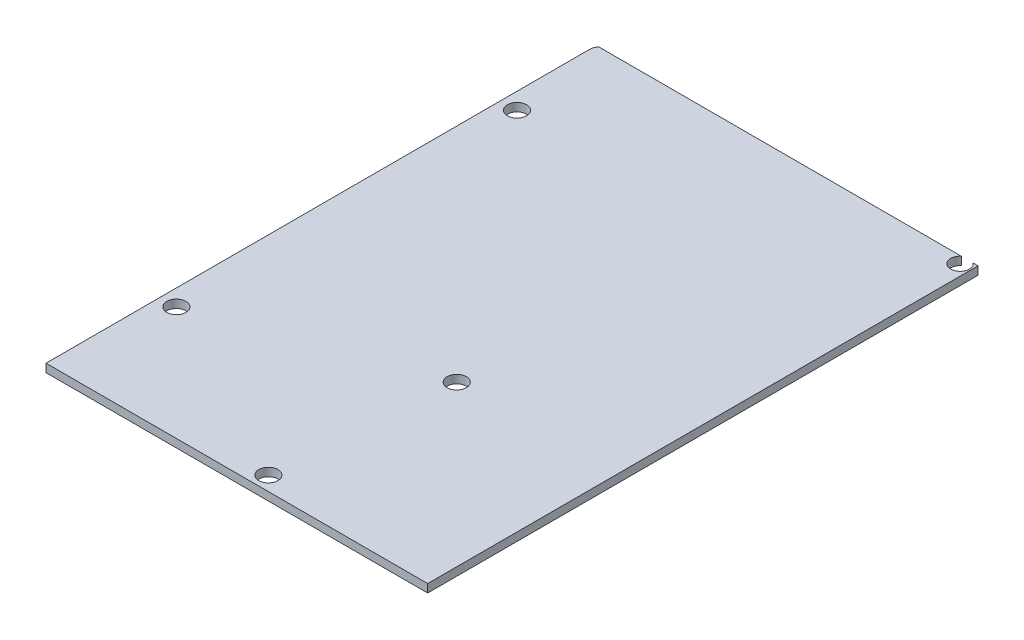
ISO-10303-21;
HEADER;
FILE_DESCRIPTION(('STEP AP214'),'2;1');
FILE_NAME('part.step','',(''),(''),'','','');
FILE_SCHEMA(('AUTOMOTIVE_DESIGN { 1 0 10303 214 1 1 1 1 }'));
ENDSEC;
DATA;
#1=APPLICATION_CONTEXT('core data for automotive mechanical design processes');
#2=APPLICATION_PROTOCOL_DEFINITION('international standard','automotive_design',2000,#1);
#3=PRODUCT_CONTEXT('',#1,'mechanical');
#4=PRODUCT('Part','Part','',(#3));
#5=PRODUCT_RELATED_PRODUCT_CATEGORY('part','',(#4));
#6=PRODUCT_DEFINITION_FORMATION('','',#4);
#7=PRODUCT_DEFINITION_CONTEXT('part definition',#1,'design');
#8=PRODUCT_DEFINITION('design','',#6,#7);
#9=PRODUCT_DEFINITION_SHAPE('','',#8);
#10=(LENGTH_UNIT() NAMED_UNIT(*) SI_UNIT(.MILLI.,.METRE.));
#11=(NAMED_UNIT(*) PLANE_ANGLE_UNIT() SI_UNIT($,.RADIAN.));
#12=(NAMED_UNIT(*) SI_UNIT($,.STERADIAN.) SOLID_ANGLE_UNIT());
#13=UNCERTAINTY_MEASURE_WITH_UNIT(LENGTH_MEASURE(1.E-05),#10,'distance_accuracy_value','');
#14=(GEOMETRIC_REPRESENTATION_CONTEXT(3) GLOBAL_UNCERTAINTY_ASSIGNED_CONTEXT((#13)) GLOBAL_UNIT_ASSIGNED_CONTEXT((#10,
#11,#12)) REPRESENTATION_CONTEXT('',''));
#15=CARTESIAN_POINT('',(0.,0.,0.));
#16=DIRECTION('',(0.,0.,1.));
#17=DIRECTION('',(1.,0.,0.));
#18=AXIS2_PLACEMENT_3D('',#15,#16,#17);
#19=CARTESIAN_POINT('',(-2.655,1.5,-0.520482398309197));
#20=DIRECTION('',(0.,1.,0.));
#21=DIRECTION('',(1.,0.,0.));
#22=AXIS2_PLACEMENT_3D('',#19,#20,#21);
#23=PLANE('',#22);
#24=CARTESIAN_POINT('',(-39.6,1.5,27.8));
#25=DIRECTION('',(0.,-1.,0.));
#26=DIRECTION('',(1.,0.,0.));
#27=AXIS2_PLACEMENT_3D('',#24,#25,#26);
#28=CIRCLE('',#27,1.75);
#29=CARTESIAN_POINT('',(-37.85,1.5,27.8));
#30=VERTEX_POINT('',#29);
#31=CARTESIAN_POINT('',(-41.35,1.5,27.8));
#32=VERTEX_POINT('',#31);
#33=EDGE_CURVE('E235',#30,#32,#28,.T.);
#34=ORIENTED_EDGE('',*,*,#33,.T.);
#35=CARTESIAN_POINT('',(-39.6,1.5,27.8));
#36=DIRECTION('',(0.,-1.,0.));
#37=DIRECTION('',(1.,0.,0.));
#38=AXIS2_PLACEMENT_3D('',#35,#36,#37);
#39=CIRCLE('',#38,1.75);
#40=EDGE_CURVE('E223',#32,#30,#39,.T.);
#41=ORIENTED_EDGE('',*,*,#40,.T.);
#42=EDGE_LOOP('',(#34,#41));
#43=FACE_BOUND('',#42,.T.);
#44=CARTESIAN_POINT('',(-2.1,1.5,14.1));
#45=DIRECTION('',(0.,-1.,0.));
#46=DIRECTION('',(1.,0.,0.));
#47=AXIS2_PLACEMENT_3D('',#44,#45,#46);
#48=CIRCLE('',#47,1.75);
#49=CARTESIAN_POINT('',(-0.350000000000008,1.5,14.1));
#50=VERTEX_POINT('',#49);
#51=CARTESIAN_POINT('',(-3.85,1.5,14.1));
#52=VERTEX_POINT('',#51);
#53=EDGE_CURVE('E244',#50,#52,#48,.T.);
#54=ORIENTED_EDGE('',*,*,#53,.T.);
#55=CARTESIAN_POINT('',(-2.1,1.5,14.1));
#56=DIRECTION('',(0.,-1.,0.));
#57=DIRECTION('',(1.,0.,0.));
#58=AXIS2_PLACEMENT_3D('',#55,#56,#57);
#59=CIRCLE('',#58,1.75);
#60=EDGE_CURVE('E112',#52,#50,#59,.T.);
#61=ORIENTED_EDGE('',*,*,#60,.T.);
#62=EDGE_LOOP('',(#54,#61));
#63=FACE_BOUND('',#62,.T.);
#64=CARTESIAN_POINT('',(-39.6,1.5,-34.4));
#65=DIRECTION('',(0.,-1.,0.));
#66=DIRECTION('',(1.,0.,0.));
#67=AXIS2_PLACEMENT_3D('',#64,#65,#66);
#68=CIRCLE('',#67,1.75);
#69=CARTESIAN_POINT('',(-37.85,1.5,-34.4));
#70=VERTEX_POINT('',#69);
#71=CARTESIAN_POINT('',(-41.35,1.5,-34.4));
#72=VERTEX_POINT('',#71);
#73=EDGE_CURVE('E209',#70,#72,#68,.T.);
#74=ORIENTED_EDGE('',*,*,#73,.T.);
#75=CARTESIAN_POINT('',(-39.6,1.5,-34.4));
#76=DIRECTION('',(0.,-1.,0.));
#77=DIRECTION('',(1.,0.,0.));
#78=AXIS2_PLACEMENT_3D('',#75,#76,#77);
#79=CIRCLE('',#78,1.75);
#80=EDGE_CURVE('E101',#72,#70,#79,.T.);
#81=ORIENTED_EDGE('',*,*,#80,.T.);
#82=EDGE_LOOP('',(#74,#81));
#83=FACE_BOUND('',#82,.T.);
#84=CARTESIAN_POINT('',(-4.6,1.5,46.));
#85=DIRECTION('',(0.,-1.,0.));
#86=DIRECTION('',(1.,0.,0.));
#87=AXIS2_PLACEMENT_3D('',#84,#85,#86);
#88=CIRCLE('',#87,1.75);
#89=CARTESIAN_POINT('',(-2.85,1.5,46.));
#90=VERTEX_POINT('',#89);
#91=CARTESIAN_POINT('',(-6.35,1.5,46.));
#92=VERTEX_POINT('',#91);
#93=EDGE_CURVE('E170',#90,#92,#88,.T.);
#94=ORIENTED_EDGE('',*,*,#93,.T.);
#95=CARTESIAN_POINT('',(-4.6,1.5,46.));
#96=DIRECTION('',(0.,-1.,0.));
#97=DIRECTION('',(1.,0.,0.));
#98=AXIS2_PLACEMENT_3D('',#95,#96,#97);
#99=CIRCLE('',#98,1.75);
#100=EDGE_CURVE('E167',#92,#90,#99,.T.);
#101=ORIENTED_EDGE('',*,*,#100,.T.);
#102=EDGE_LOOP('',(#94,#101));
#103=FACE_BOUND('',#102,.T.);
#104=CARTESIAN_POINT('',(25.1353213902922,1.5,-50.5909647966184));
#105=DIRECTION('',(0.,-1.,0.));
#106=DIRECTION('',(1.,0.,0.));
#107=AXIS2_PLACEMENT_3D('',#104,#105,#106);
#108=CIRCLE('',#107,1.7);
#109=CARTESIAN_POINT('',(26.2287993093726,1.49999995944139,-51.8926199124165));
#110=VERTEX_POINT('',#109);
#111=CARTESIAN_POINT('',(24.0418434712117,1.49999995944139,-51.8926199124165));
#112=VERTEX_POINT('',#111);
#113=EDGE_CURVE('E256',#110,#112,#108,.T.);
#114=ORIENTED_EDGE('',*,*,#113,.T.);
#115=DIRECTION('',(-1.,0.,0.));
#116=VECTOR('',#115,1.);
#117=CARTESIAN_POINT('',(-21.0630749900934,1.5,-51.8926199124165));
#118=LINE('',#117,#116);
#119=CARTESIAN_POINT('',(-42.1261499801869,1.49999995944139,-51.8926199124165));
#120=VERTEX_POINT('',#119);
#121=EDGE_CURVE('E236',#112,#120,#118,.T.);
#122=ORIENTED_EDGE('',*,*,#121,.T.);
#123=CARTESIAN_POINT('',(-40.6,1.5,-50.6));
#124=DIRECTION('',(0.,-1.,0.));
#125=DIRECTION('',(-0.707106781186548,0.,-0.707106781186548));
#126=AXIS2_PLACEMENT_3D('',#123,#124,#125);
#127=CIRCLE('',#126,2.);
#128=CARTESIAN_POINT('',(-42.6,1.5,-50.6));
#129=VERTEX_POINT('',#128);
#130=EDGE_CURVE('E195',#129,#120,#127,.T.);
#131=ORIENTED_EDGE('',*,*,#130,.F.);
#132=DIRECTION('',(0.,0.,1.));
#133=VECTOR('',#132,1.);
#134=CARTESIAN_POINT('',(-42.6,1.5,-52.6));
#135=LINE('',#134,#133);
#136=CARTESIAN_POINT('',(-42.6,1.49999995944139,48.6073800875835));
#137=VERTEX_POINT('',#136);
#138=EDGE_CURVE('E194',#129,#137,#135,.T.);
#139=ORIENTED_EDGE('',*,*,#138,.T.);
#140=DIRECTION('',(-1.,0.,0.));
#141=VECTOR('',#140,1.);
#142=CARTESIAN_POINT('',(-42.9,1.49999995944139,48.6073800875835));
#143=LINE('',#142,#141);
#144=CARTESIAN_POINT('',(27.1,1.49999995944139,48.6073800875835));
#145=VERTEX_POINT('',#144);
#146=EDGE_CURVE('E11',#145,#137,#143,.T.);
#147=ORIENTED_EDGE('',*,*,#146,.F.);
#148=DIRECTION('',(0.,0.,1.));
#149=VECTOR('',#148,1.);
#150=CARTESIAN_POINT('',(27.1,1.49999995944139,48.6073800875835));
#151=LINE('',#150,#149);
#152=CARTESIAN_POINT('',(27.1,1.49999995944139,-51.8926199124165));
#153=VERTEX_POINT('',#152);
#154=EDGE_CURVE('E206',#153,#145,#151,.T.);
#155=ORIENTED_EDGE('',*,*,#154,.F.);
#156=DIRECTION('',(-1.,0.,0.));
#157=VECTOR('',#156,1.);
#158=CARTESIAN_POINT('',(13.1143996546863,1.5,-51.8926199124165));
#159=LINE('',#158,#157);
#160=EDGE_CURVE('E239',#153,#110,#159,.T.);
#161=ORIENTED_EDGE('',*,*,#160,.T.);
#162=EDGE_LOOP('',(#114,#122,#131,#139,#147,#155,#161));
#163=FACE_BOUND('',#162,.T.);
#164=ADVANCED_FACE('F17',(#43,#63,#83,#103,#163),#23,.T.);
#165=CARTESIAN_POINT('',(27.1,4.05586098040089E-08,48.6073800875835));
#166=DIRECTION('',(0.,0.,-1.));
#167=DIRECTION('',(0.,-1.,0.));
#168=AXIS2_PLACEMENT_3D('',#165,#166,#167);
#169=PLANE('',#168);
#170=DIRECTION('',(-1.,0.,0.));
#171=VECTOR('',#170,1.);
#172=CARTESIAN_POINT('',(13.55,0.,48.6073800875835));
#173=LINE('',#172,#171);
#174=CARTESIAN_POINT('',(27.1,4.05586098040089E-08,48.6073800875835));
#175=VERTEX_POINT('',#174);
#176=CARTESIAN_POINT('',(-42.6,4.05586098040089E-08,48.6073800875835));
#177=VERTEX_POINT('',#176);
#178=EDGE_CURVE('E201',#175,#177,#173,.T.);
#179=ORIENTED_EDGE('',*,*,#178,.F.);
#180=DIRECTION('',(0.,1.,0.));
#181=VECTOR('',#180,1.);
#182=CARTESIAN_POINT('',(27.1,4.05586098040089E-08,48.6073800875835));
#183=LINE('',#182,#181);
#184=EDGE_CURVE('E27',#175,#145,#183,.T.);
#185=ORIENTED_EDGE('',*,*,#184,.T.);
#186=ORIENTED_EDGE('',*,*,#146,.T.);
#187=DIRECTION('',(0.,1.,0.));
#188=VECTOR('',#187,1.);
#189=CARTESIAN_POINT('',(-42.6,2.02793049020045E-08,48.6073800875835));
#190=LINE('',#189,#188);
#191=EDGE_CURVE('E69',#177,#137,#190,.T.);
#192=ORIENTED_EDGE('',*,*,#191,.F.);
#193=EDGE_LOOP('',(#179,#185,#186,#192));
#194=FACE_BOUND('',#193,.T.);
#195=ADVANCED_FACE('F291',(#194),#169,.F.);
#196=CARTESIAN_POINT('',(27.1,4.05586098040089E-08,-51.8926199124165));
#197=DIRECTION('',(-1.,0.,0.));
#198=DIRECTION('',(0.,0.,1.));
#199=AXIS2_PLACEMENT_3D('',#196,#197,#198);
#200=PLANE('',#199);
#201=DIRECTION('',(0.,0.,1.));
#202=VECTOR('',#201,1.);
#203=CARTESIAN_POINT('',(27.1,0.,-25.9463099562083));
#204=LINE('',#203,#202);
#205=CARTESIAN_POINT('',(27.1,4.05586098040089E-08,-51.8926199124165));
#206=VERTEX_POINT('',#205);
#207=EDGE_CURVE('E273',#206,#175,#204,.T.);
#208=ORIENTED_EDGE('',*,*,#207,.F.);
#209=DIRECTION('',(0.,1.,0.));
#210=VECTOR('',#209,1.);
#211=CARTESIAN_POINT('',(27.1,4.05586098040089E-08,-51.8926199124165));
#212=LINE('',#211,#210);
#213=EDGE_CURVE('E191',#206,#153,#212,.T.);
#214=ORIENTED_EDGE('',*,*,#213,.T.);
#215=ORIENTED_EDGE('',*,*,#154,.T.);
#216=ORIENTED_EDGE('',*,*,#184,.F.);
#217=EDGE_LOOP('',(#208,#214,#215,#216));
#218=FACE_BOUND('',#217,.T.);
#219=ADVANCED_FACE('F347',(#218),#200,.F.);
#220=CARTESIAN_POINT('',(26.2287993093726,4.05586098040089E-08,-51.8926199124165));
#221=DIRECTION('',(0.,0.,1.));
#222=DIRECTION('',(1.,0.,0.));
#223=AXIS2_PLACEMENT_3D('',#220,#221,#222);
#224=PLANE('',#223);
#225=DIRECTION('',(1.,0.,0.));
#226=VECTOR('',#225,1.);
#227=CARTESIAN_POINT('',(13.1143996546863,0.,-51.8926199124165));
#228=LINE('',#227,#226);
#229=CARTESIAN_POINT('',(26.2287993093726,4.05586098040089E-08,-51.8926199124165));
#230=VERTEX_POINT('',#229);
#231=EDGE_CURVE('E251',#230,#206,#228,.T.);
#232=ORIENTED_EDGE('',*,*,#231,.F.);
#233=DIRECTION('',(0.,1.,0.));
#234=VECTOR('',#233,1.);
#235=CARTESIAN_POINT('',(26.2287993093726,4.05586098040089E-08,-51.8926199124165));
#236=LINE('',#235,#234);
#237=EDGE_CURVE('E252',#230,#110,#236,.T.);
#238=ORIENTED_EDGE('',*,*,#237,.T.);
#239=ORIENTED_EDGE('',*,*,#160,.F.);
#240=ORIENTED_EDGE('',*,*,#213,.F.);
#241=EDGE_LOOP('',(#232,#238,#239,#240));
#242=FACE_BOUND('',#241,.T.);
#243=ADVANCED_FACE('F345',(#242),#224,.F.);
#244=CARTESIAN_POINT('',(-42.1261499801868,4.05586098040089E-08,-51.8926199124165));
#245=DIRECTION('',(0.,0.,1.));
#246=DIRECTION('',(1.,0.,0.));
#247=AXIS2_PLACEMENT_3D('',#244,#245,#246);
#248=PLANE('',#247);
#249=DIRECTION('',(1.,0.,0.));
#250=VECTOR('',#249,1.);
#251=CARTESIAN_POINT('',(-21.0630749900934,0.,-51.8926199124165));
#252=LINE('',#251,#250);
#253=CARTESIAN_POINT('',(-42.1261499801869,4.05586098040089E-08,-51.8926199124165));
#254=VERTEX_POINT('',#253);
#255=CARTESIAN_POINT('',(24.0418434712117,4.05586098040089E-08,-51.8926199124165));
#256=VERTEX_POINT('',#255);
#257=EDGE_CURVE('E177',#254,#256,#252,.T.);
#258=ORIENTED_EDGE('',*,*,#257,.F.);
#259=DIRECTION('',(0.,-1.,0.));
#260=VECTOR('',#259,1.);
#261=CARTESIAN_POINT('',(-42.1261499801869,0.,-51.8926199124165));
#262=LINE('',#261,#260);
#263=EDGE_CURVE('E154',#120,#254,#262,.T.);
#264=ORIENTED_EDGE('',*,*,#263,.F.);
#265=ORIENTED_EDGE('',*,*,#121,.F.);
#266=DIRECTION('',(0.,1.,0.));
#267=VECTOR('',#266,1.);
#268=CARTESIAN_POINT('',(24.0418434712117,4.05586098040089E-08,-51.8926199124165));
#269=LINE('',#268,#267);
#270=EDGE_CURVE('E269',#256,#112,#269,.T.);
#271=ORIENTED_EDGE('',*,*,#270,.F.);
#272=EDGE_LOOP('',(#258,#264,#265,#271));
#273=FACE_BOUND('',#272,.T.);
#274=ADVANCED_FACE('F19',(#273),#248,.F.);
#275=CARTESIAN_POINT('',(-4.6,-133.882162783729,46.));
#276=DIRECTION('',(0.,1.,0.));
#277=DIRECTION('',(1.,0.,0.));
#278=AXIS2_PLACEMENT_3D('',#275,#276,#277);
#279=CYLINDRICAL_SURFACE('',#278,1.75);
#280=CARTESIAN_POINT('',(-4.6,0.,46.));
#281=DIRECTION('',(0.,1.,0.));
#282=DIRECTION('',(1.,0.,0.));
#283=AXIS2_PLACEMENT_3D('',#280,#281,#282);
#284=CIRCLE('',#283,1.75);
#285=CARTESIAN_POINT('',(-6.35,0.,46.));
#286=VERTEX_POINT('',#285);
#287=EDGE_CURVE('E165',#286,#286,#284,.T.);
#288=ORIENTED_EDGE('',*,*,#287,.F.);
#289=DIRECTION('',(0.,1.,0.));
#290=VECTOR('',#289,1.);
#291=CARTESIAN_POINT('',(-6.35,-133.882162783729,46.));
#292=LINE('',#291,#290);
#293=EDGE_CURVE('E162',#286,#92,#292,.T.);
#294=ORIENTED_EDGE('',*,*,#293,.T.);
#295=ORIENTED_EDGE('',*,*,#93,.F.);
#296=ORIENTED_EDGE('',*,*,#100,.F.);
#297=ORIENTED_EDGE('',*,*,#293,.F.);
#298=EDGE_LOOP('',(#288,#294,#295,#296,#297));
#299=FACE_BOUND('',#298,.T.);
#300=ADVANCED_FACE('F164',(#299),#279,.F.);
#301=CARTESIAN_POINT('',(-39.6,-133.882162783729,-34.4));
#302=DIRECTION('',(0.,1.,0.));
#303=DIRECTION('',(1.,0.,0.));
#304=AXIS2_PLACEMENT_3D('',#301,#302,#303);
#305=CYLINDRICAL_SURFACE('',#304,1.75);
#306=CARTESIAN_POINT('',(-39.6,0.,-34.4));
#307=DIRECTION('',(0.,1.,0.));
#308=DIRECTION('',(1.,0.,0.));
#309=AXIS2_PLACEMENT_3D('',#306,#307,#308);
#310=CIRCLE('',#309,1.75);
#311=CARTESIAN_POINT('',(-41.35,0.,-34.4));
#312=VERTEX_POINT('',#311);
#313=EDGE_CURVE('E176',#312,#312,#310,.T.);
#314=ORIENTED_EDGE('',*,*,#313,.F.);
#315=DIRECTION('',(0.,1.,0.));
#316=VECTOR('',#315,1.);
#317=CARTESIAN_POINT('',(-41.35,-133.882162783729,-34.4));
#318=LINE('',#317,#316);
#319=EDGE_CURVE('E214',#312,#72,#318,.T.);
#320=ORIENTED_EDGE('',*,*,#319,.T.);
#321=ORIENTED_EDGE('',*,*,#73,.F.);
#322=ORIENTED_EDGE('',*,*,#80,.F.);
#323=ORIENTED_EDGE('',*,*,#319,.F.);
#324=EDGE_LOOP('',(#314,#320,#321,#322,#323));
#325=FACE_BOUND('',#324,.T.);
#326=ADVANCED_FACE('F332',(#325),#305,.F.);
#327=CARTESIAN_POINT('',(-2.1,-133.882162783729,14.1));
#328=DIRECTION('',(0.,1.,0.));
#329=DIRECTION('',(1.,0.,0.));
#330=AXIS2_PLACEMENT_3D('',#327,#328,#329);
#331=CYLINDRICAL_SURFACE('',#330,1.75);
#332=CARTESIAN_POINT('',(-2.1,0.,14.1));
#333=DIRECTION('',(0.,1.,0.));
#334=DIRECTION('',(1.,0.,0.));
#335=AXIS2_PLACEMENT_3D('',#332,#333,#334);
#336=CIRCLE('',#335,1.75);
#337=CARTESIAN_POINT('',(-3.85,0.,14.1));
#338=VERTEX_POINT('',#337);
#339=EDGE_CURVE('E185',#338,#338,#336,.T.);
#340=ORIENTED_EDGE('',*,*,#339,.F.);
#341=DIRECTION('',(0.,1.,0.));
#342=VECTOR('',#341,1.);
#343=CARTESIAN_POINT('',(-3.85,-133.882162783729,14.1));
#344=LINE('',#343,#342);
#345=EDGE_CURVE('E265',#338,#52,#344,.T.);
#346=ORIENTED_EDGE('',*,*,#345,.T.);
#347=ORIENTED_EDGE('',*,*,#53,.F.);
#348=ORIENTED_EDGE('',*,*,#60,.F.);
#349=ORIENTED_EDGE('',*,*,#345,.F.);
#350=EDGE_LOOP('',(#340,#346,#347,#348,#349));
#351=FACE_BOUND('',#350,.T.);
#352=ADVANCED_FACE('F334',(#351),#331,.F.);
#353=CARTESIAN_POINT('',(-39.6,-133.882162783729,27.8));
#354=DIRECTION('',(0.,1.,0.));
#355=DIRECTION('',(1.,0.,0.));
#356=AXIS2_PLACEMENT_3D('',#353,#354,#355);
#357=CYLINDRICAL_SURFACE('',#356,1.75);
#358=CARTESIAN_POINT('',(-39.6,0.,27.8));
#359=DIRECTION('',(0.,1.,0.));
#360=DIRECTION('',(1.,0.,0.));
#361=AXIS2_PLACEMENT_3D('',#358,#359,#360);
#362=CIRCLE('',#361,1.75);
#363=CARTESIAN_POINT('',(-41.35,0.,27.8));
#364=VERTEX_POINT('',#363);
#365=EDGE_CURVE('E225',#364,#364,#362,.T.);
#366=ORIENTED_EDGE('',*,*,#365,.F.);
#367=DIRECTION('',(0.,1.,0.));
#368=VECTOR('',#367,1.);
#369=CARTESIAN_POINT('',(-41.35,-133.882162783729,27.8));
#370=LINE('',#369,#368);
#371=EDGE_CURVE('E205',#364,#32,#370,.T.);
#372=ORIENTED_EDGE('',*,*,#371,.T.);
#373=ORIENTED_EDGE('',*,*,#33,.F.);
#374=ORIENTED_EDGE('',*,*,#40,.F.);
#375=ORIENTED_EDGE('',*,*,#371,.F.);
#376=EDGE_LOOP('',(#366,#372,#373,#374,#375));
#377=FACE_BOUND('',#376,.T.);
#378=ADVANCED_FACE('F324',(#377),#357,.F.);
#379=CARTESIAN_POINT('',(-42.6,0.,-52.6));
#380=DIRECTION('',(-1.,0.,0.));
#381=DIRECTION('',(0.,0.,1.));
#382=AXIS2_PLACEMENT_3D('',#379,#380,#381);
#383=PLANE('',#382);
#384=ORIENTED_EDGE('',*,*,#191,.T.);
#385=ORIENTED_EDGE('',*,*,#138,.F.);
#386=DIRECTION('',(0.,1.,0.));
#387=VECTOR('',#386,1.);
#388=CARTESIAN_POINT('',(-42.6,0.,-50.6));
#389=LINE('',#388,#387);
#390=CARTESIAN_POINT('',(-42.6,0.,-50.6));
#391=VERTEX_POINT('',#390);
#392=EDGE_CURVE('E231',#391,#129,#389,.T.);
#393=ORIENTED_EDGE('',*,*,#392,.F.);
#394=DIRECTION('',(0.,0.,1.));
#395=VECTOR('',#394,1.);
#396=CARTESIAN_POINT('',(-42.6,0.,-52.6));
#397=LINE('',#396,#395);
#398=EDGE_CURVE('E199',#391,#177,#397,.T.);
#399=ORIENTED_EDGE('',*,*,#398,.T.);
#400=EDGE_LOOP('',(#384,#385,#393,#399));
#401=FACE_BOUND('',#400,.T.);
#402=ADVANCED_FACE('F309',(#401),#383,.T.);
#403=CARTESIAN_POINT('',(-40.6,0.,-50.6));
#404=DIRECTION('',(0.,1.,0.));
#405=DIRECTION('',(-0.707106781186548,0.,-0.707106781186548));
#406=AXIS2_PLACEMENT_3D('',#403,#404,#405);
#407=CYLINDRICAL_SURFACE('',#406,2.);
#408=ORIENTED_EDGE('',*,*,#263,.T.);
#409=CARTESIAN_POINT('',(-40.6,0.,-50.6));
#410=DIRECTION('',(0.,1.,0.));
#411=DIRECTION('',(-0.707106781186548,0.,-0.707106781186548));
#412=AXIS2_PLACEMENT_3D('',#409,#410,#411);
#413=CIRCLE('',#412,2.);
#414=EDGE_CURVE('E187',#254,#391,#413,.T.);
#415=ORIENTED_EDGE('',*,*,#414,.T.);
#416=ORIENTED_EDGE('',*,*,#392,.T.);
#417=ORIENTED_EDGE('',*,*,#130,.T.);
#418=EDGE_LOOP('',(#408,#415,#416,#417));
#419=FACE_BOUND('',#418,.T.);
#420=ADVANCED_FACE('F306',(#419),#407,.T.);
#421=CARTESIAN_POINT('',(0.,0.,0.));
#422=DIRECTION('',(0.,1.,0.));
#423=DIRECTION('',(1.,0.,0.));
#424=AXIS2_PLACEMENT_3D('',#421,#422,#423);
#425=PLANE('',#424);
#426=ORIENTED_EDGE('',*,*,#365,.T.);
#427=EDGE_LOOP('',(#426));
#428=FACE_BOUND('',#427,.T.);
#429=ORIENTED_EDGE('',*,*,#339,.T.);
#430=EDGE_LOOP('',(#429));
#431=FACE_BOUND('',#430,.T.);
#432=ORIENTED_EDGE('',*,*,#313,.T.);
#433=EDGE_LOOP('',(#432));
#434=FACE_BOUND('',#433,.T.);
#435=ORIENTED_EDGE('',*,*,#287,.T.);
#436=EDGE_LOOP('',(#435));
#437=FACE_BOUND('',#436,.T.);
#438=CARTESIAN_POINT('',(25.1353213902922,0.,-50.5909647966184));
#439=DIRECTION('',(0.,1.,0.));
#440=DIRECTION('',(1.,0.,0.));
#441=AXIS2_PLACEMENT_3D('',#438,#439,#440);
#442=CIRCLE('',#441,1.7);
#443=EDGE_CURVE('E247',#256,#230,#442,.T.);
#444=ORIENTED_EDGE('',*,*,#443,.T.);
#445=ORIENTED_EDGE('',*,*,#231,.T.);
#446=ORIENTED_EDGE('',*,*,#207,.T.);
#447=ORIENTED_EDGE('',*,*,#178,.T.);
#448=ORIENTED_EDGE('',*,*,#398,.F.);
#449=ORIENTED_EDGE('',*,*,#414,.F.);
#450=ORIENTED_EDGE('',*,*,#257,.T.);
#451=EDGE_LOOP('',(#444,#445,#446,#447,#448,#449,#450));
#452=FACE_BOUND('',#451,.T.);
#453=ADVANCED_FACE('F173',(#428,#431,#434,#437,#452),#425,.F.);
#454=CARTESIAN_POINT('',(25.1353213902922,4.05586098040089E-08,-50.5909647966184));
#455=DIRECTION('',(0.,1.,0.));
#456=DIRECTION('',(0.,0.,1.));
#457=AXIS2_PLACEMENT_3D('',#454,#455,#456);
#458=CYLINDRICAL_SURFACE('',#457,1.7);
#459=ORIENTED_EDGE('',*,*,#270,.T.);
#460=ORIENTED_EDGE('',*,*,#113,.F.);
#461=ORIENTED_EDGE('',*,*,#237,.F.);
#462=ORIENTED_EDGE('',*,*,#443,.F.);
#463=EDGE_LOOP('',(#459,#460,#461,#462));
#464=FACE_BOUND('',#463,.T.);
#465=ADVANCED_FACE('F301',(#464),#458,.F.);
#466=CLOSED_SHELL('',(#164,#195,#219,#243,#274,#300,#326,#352,#378,#402,#420,#453,#465));
#467=MANIFOLD_SOLID_BREP('B1',#466);
#468=ADVANCED_BREP_SHAPE_REPRESENTATION('',(#18,#467),#14);
#469=SHAPE_DEFINITION_REPRESENTATION(#9,#468);
ENDSEC;
END-ISO-10303-21;
